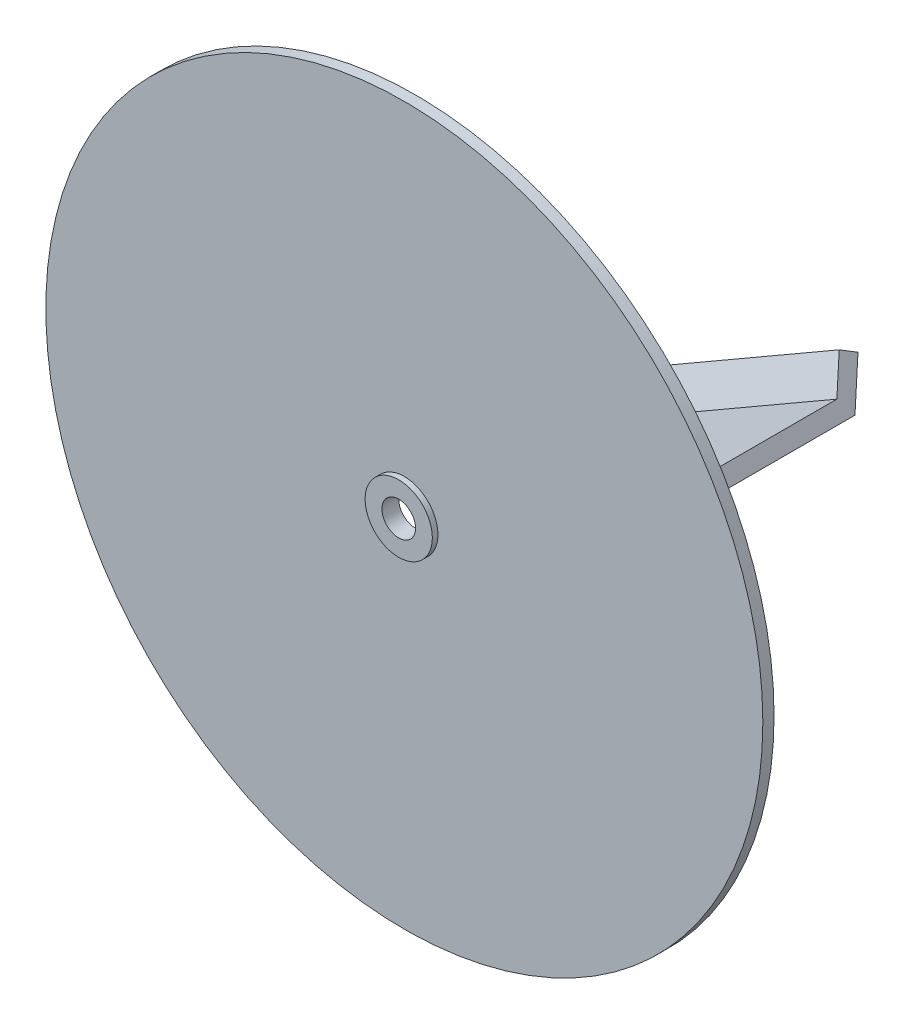
ISO-10303-21;
HEADER;
FILE_DESCRIPTION(('STEP AP214'),'2;1');
FILE_NAME('part.step','',(''),(''),'','','');
FILE_SCHEMA(('AUTOMOTIVE_DESIGN { 1 0 10303 214 1 1 1 1 }'));
ENDSEC;
DATA;
#1=APPLICATION_CONTEXT('core data for automotive mechanical design processes');
#2=APPLICATION_PROTOCOL_DEFINITION('international standard','automotive_design',2000,#1);
#3=PRODUCT_CONTEXT('',#1,'mechanical');
#4=PRODUCT('Part','Part','',(#3));
#5=PRODUCT_RELATED_PRODUCT_CATEGORY('part','',(#4));
#6=PRODUCT_DEFINITION_FORMATION('','',#4);
#7=PRODUCT_DEFINITION_CONTEXT('part definition',#1,'design');
#8=PRODUCT_DEFINITION('design','',#6,#7);
#9=PRODUCT_DEFINITION_SHAPE('','',#8);
#10=(LENGTH_UNIT() NAMED_UNIT(*) SI_UNIT(.MILLI.,.METRE.));
#11=(NAMED_UNIT(*) PLANE_ANGLE_UNIT() SI_UNIT($,.RADIAN.));
#12=(NAMED_UNIT(*) SI_UNIT($,.STERADIAN.) SOLID_ANGLE_UNIT());
#13=UNCERTAINTY_MEASURE_WITH_UNIT(LENGTH_MEASURE(1.E-05),#10,'distance_accuracy_value','');
#14=(GEOMETRIC_REPRESENTATION_CONTEXT(3) GLOBAL_UNCERTAINTY_ASSIGNED_CONTEXT((#13)) GLOBAL_UNIT_ASSIGNED_CONTEXT((#10,
#11,#12)) REPRESENTATION_CONTEXT('',''));
#15=CARTESIAN_POINT('',(0.,0.,0.));
#16=DIRECTION('',(0.,0.,1.));
#17=DIRECTION('',(1.,0.,0.));
#18=AXIS2_PLACEMENT_3D('',#15,#16,#17);
#19=CARTESIAN_POINT('',(0.,0.,6.35));
#20=DIRECTION('',(0.,0.,1.));
#21=DIRECTION('',(1.,0.,0.));
#22=AXIS2_PLACEMENT_3D('',#19,#20,#21);
#23=PLANE('',#22);
#24=CARTESIAN_POINT('',(0.,0.,6.35));
#25=DIRECTION('',(0.,0.,1.));
#26=DIRECTION('',(1.,0.,0.));
#27=AXIS2_PLACEMENT_3D('',#24,#25,#26);
#28=CIRCLE('',#27,203.2);
#29=CARTESIAN_POINT('',(203.2,0.,6.35));
#30=VERTEX_POINT('',#29);
#31=EDGE_CURVE('E11',#30,#30,#28,.T.);
#32=ORIENTED_EDGE('',*,*,#31,.T.);
#33=EDGE_LOOP('',(#32));
#34=FACE_BOUND('',#33,.T.);
#35=CARTESIAN_POINT('',(0.,0.,6.35));
#36=DIRECTION('',(0.,0.,1.));
#37=DIRECTION('',(1.,0.,0.));
#38=AXIS2_PLACEMENT_3D('',#35,#36,#37);
#39=CIRCLE('',#38,19.05);
#40=CARTESIAN_POINT('',(19.05,0.,6.35));
#41=VERTEX_POINT('',#40);
#42=EDGE_CURVE('E514',#41,#41,#39,.T.);
#43=ORIENTED_EDGE('',*,*,#42,.F.);
#44=EDGE_LOOP('',(#43));
#45=FACE_BOUND('',#44,.T.);
#46=ADVANCED_FACE('F48',(#34,#45),#23,.T.);
#47=CARTESIAN_POINT('',(0.,0.,0.));
#48=DIRECTION('',(0.,0.,1.));
#49=DIRECTION('',(1.,0.,0.));
#50=AXIS2_PLACEMENT_3D('',#47,#48,#49);
#51=PLANE('',#50);
#52=DIRECTION('',(0.866025403784443,-0.499999999999992,0.));
#53=VECTOR('',#52,1.);
#54=CARTESIAN_POINT('',(-168.095850734968,102.549445985522,0.));
#55=LINE('',#54,#53);
#56=CARTESIAN_POINT('',(-168.095850734968,102.549445985522,0.));
#57=VERTEX_POINT('',#56);
#58=CARTESIAN_POINT('',(-19.6157952561249,16.8244459855232,0.));
#59=VERTEX_POINT('',#58);
#60=EDGE_CURVE('E67',#57,#59,#55,.T.);
#61=ORIENTED_EDGE('',*,*,#60,.F.);
#62=DIRECTION('',(-0.499999999999992,-0.866025403784443,0.));
#63=VECTOR('',#62,1.);
#64=CARTESIAN_POINT('',(-172.858350734968,94.300554014475,0.));
#65=LINE('',#64,#63);
#66=CARTESIAN_POINT('',(-172.858350734968,94.300554014475,0.));
#67=VERTEX_POINT('',#66);
#68=EDGE_CURVE('E72',#57,#67,#65,.T.);
#69=ORIENTED_EDGE('',*,*,#68,.T.);
#70=DIRECTION('',(0.866025403784443,-0.499999999999992,0.));
#71=VECTOR('',#70,1.);
#72=CARTESIAN_POINT('',(-172.858350734968,94.300554014475,0.));
#73=LINE('',#72,#71);
#74=CARTESIAN_POINT('',(-24.3782952561248,8.57555401447638,0.));
#75=VERTEX_POINT('',#74);
#76=EDGE_CURVE('E198',#67,#75,#73,.T.);
#77=ORIENTED_EDGE('',*,*,#76,.T.);
#78=DIRECTION('',(-0.499999999999992,-0.866025403784443,0.));
#79=VECTOR('',#78,1.);
#80=CARTESIAN_POINT('',(-24.3782952561248,8.57555401447638,0.));
#81=LINE('',#80,#79);
#82=EDGE_CURVE('E228',#59,#75,#81,.T.);
#83=ORIENTED_EDGE('',*,*,#82,.F.);
#84=EDGE_LOOP('',(#61,#69,#77,#83));
#85=FACE_BOUND('',#84,.T.);
#86=DIRECTION('',(-0.866025403784436,-0.500000000000004,0.));
#87=VECTOR('',#86,1.);
#88=CARTESIAN_POINT('',(172.858350734966,94.3005540144774,0.));
#89=LINE('',#88,#87);
#90=CARTESIAN_POINT('',(172.858350734966,94.3005540144774,0.));
#91=VERTEX_POINT('',#90);
#92=CARTESIAN_POINT('',(24.3782952561247,8.57555401447672,0.));
#93=VERTEX_POINT('',#92);
#94=EDGE_CURVE('E309',#91,#93,#89,.T.);
#95=ORIENTED_EDGE('',*,*,#94,.F.);
#96=DIRECTION('',(-0.500000000000004,0.866025403784436,0.));
#97=VECTOR('',#96,1.);
#98=CARTESIAN_POINT('',(168.095850734966,102.549445985524,0.));
#99=LINE('',#98,#97);
#100=CARTESIAN_POINT('',(168.095850734966,102.549445985524,0.));
#101=VERTEX_POINT('',#100);
#102=EDGE_CURVE('E262',#91,#101,#99,.T.);
#103=ORIENTED_EDGE('',*,*,#102,.T.);
#104=DIRECTION('',(-0.866025403784436,-0.500000000000004,0.));
#105=VECTOR('',#104,1.);
#106=CARTESIAN_POINT('',(168.095850734966,102.549445985524,0.));
#107=LINE('',#106,#105);
#108=CARTESIAN_POINT('',(19.6157952561247,16.8244459855235,0.));
#109=VERTEX_POINT('',#108);
#110=EDGE_CURVE('E286',#101,#109,#107,.T.);
#111=ORIENTED_EDGE('',*,*,#110,.T.);
#112=DIRECTION('',(-0.500000000000004,0.866025403784436,0.));
#113=VECTOR('',#112,1.);
#114=CARTESIAN_POINT('',(19.6157952561247,16.8244459855235,0.));
#115=LINE('',#114,#113);
#116=EDGE_CURVE('E251',#93,#109,#115,.T.);
#117=ORIENTED_EDGE('',*,*,#116,.F.);
#118=EDGE_LOOP('',(#95,#103,#111,#117));
#119=FACE_BOUND('',#118,.T.);
#120=DIRECTION('',(0.,1.,0.));
#121=VECTOR('',#120,1.);
#122=CARTESIAN_POINT('',(-4.7625,-196.85,0.));
#123=LINE('',#122,#121);
#124=CARTESIAN_POINT('',(-4.7625,-196.85,0.));
#125=VERTEX_POINT('',#124);
#126=CARTESIAN_POINT('',(-4.7625,-25.4,0.));
#127=VERTEX_POINT('',#126);
#128=EDGE_CURVE('E375',#125,#127,#123,.T.);
#129=ORIENTED_EDGE('',*,*,#128,.F.);
#130=DIRECTION('',(1.,0.,0.));
#131=VECTOR('',#130,1.);
#132=CARTESIAN_POINT('',(4.7625,-196.85,0.));
#133=LINE('',#132,#131);
#134=CARTESIAN_POINT('',(4.7625,-196.85,0.));
#135=VERTEX_POINT('',#134);
#136=EDGE_CURVE('E328',#125,#135,#133,.T.);
#137=ORIENTED_EDGE('',*,*,#136,.T.);
#138=DIRECTION('',(0.,1.,0.));
#139=VECTOR('',#138,1.);
#140=CARTESIAN_POINT('',(4.7625,-196.85,0.));
#141=LINE('',#140,#139);
#142=CARTESIAN_POINT('',(4.7625,-25.4,0.));
#143=VERTEX_POINT('',#142);
#144=EDGE_CURVE('E352',#135,#143,#141,.T.);
#145=ORIENTED_EDGE('',*,*,#144,.T.);
#146=DIRECTION('',(1.,0.,0.));
#147=VECTOR('',#146,1.);
#148=CARTESIAN_POINT('',(4.7625,-25.4,0.));
#149=LINE('',#148,#147);
#150=EDGE_CURVE('E313',#127,#143,#149,.T.);
#151=ORIENTED_EDGE('',*,*,#150,.F.);
#152=EDGE_LOOP('',(#129,#137,#145,#151));
#153=FACE_BOUND('',#152,.T.);
#154=CARTESIAN_POINT('',(0.,0.,0.));
#155=DIRECTION('',(0.,0.,1.));
#156=DIRECTION('',(1.,0.,0.));
#157=AXIS2_PLACEMENT_3D('',#154,#155,#156);
#158=CIRCLE('',#157,203.2);
#159=CARTESIAN_POINT('',(203.2,0.,0.));
#160=VERTEX_POINT('',#159);
#161=EDGE_CURVE('E52',#160,#160,#158,.T.);
#162=ORIENTED_EDGE('',*,*,#161,.F.);
#163=EDGE_LOOP('',(#162));
#164=FACE_BOUND('',#163,.T.);
#165=CARTESIAN_POINT('',(0.,0.,0.));
#166=DIRECTION('',(0.,0.,1.));
#167=DIRECTION('',(1.,0.,0.));
#168=AXIS2_PLACEMENT_3D('',#165,#166,#167);
#169=CIRCLE('',#168,9.525);
#170=CARTESIAN_POINT('',(9.525,0.,0.));
#171=VERTEX_POINT('',#170);
#172=EDGE_CURVE('E379',#171,#171,#169,.T.);
#173=ORIENTED_EDGE('',*,*,#172,.T.);
#174=EDGE_LOOP('',(#173));
#175=FACE_BOUND('',#174,.T.);
#176=ADVANCED_FACE('F405',(#85,#119,#153,#164,#175),#51,.F.);
#177=CARTESIAN_POINT('',(0.,0.,6.35));
#178=DIRECTION('',(0.,0.,-1.));
#179=DIRECTION('',(-1.,0.,0.));
#180=AXIS2_PLACEMENT_3D('',#177,#178,#179);
#181=CYLINDRICAL_SURFACE('',#180,203.2);
#182=ORIENTED_EDGE('',*,*,#31,.F.);
#183=EDGE_LOOP('',(#182));
#184=FACE_BOUND('',#183,.T.);
#185=ORIENTED_EDGE('',*,*,#161,.T.);
#186=EDGE_LOOP('',(#185));
#187=FACE_BOUND('',#186,.T.);
#188=ADVANCED_FACE('F50',(#184,#187),#181,.T.);
#189=CARTESIAN_POINT('',(0.,0.,6.35));
#190=DIRECTION('',(0.,0.,-1.));
#191=DIRECTION('',(-1.,0.,0.));
#192=AXIS2_PLACEMENT_3D('',#189,#190,#191);
#193=CYLINDRICAL_SURFACE('',#192,9.525);
#194=ORIENTED_EDGE('',*,*,#172,.F.);
#195=EDGE_LOOP('',(#194));
#196=FACE_BOUND('',#195,.T.);
#197=CARTESIAN_POINT('',(0.,0.,9.525));
#198=DIRECTION('',(0.,0.,1.));
#199=DIRECTION('',(1.,0.,0.));
#200=AXIS2_PLACEMENT_3D('',#197,#198,#199);
#201=CIRCLE('',#200,9.525);
#202=CARTESIAN_POINT('',(9.525,0.,9.525));
#203=VERTEX_POINT('',#202);
#204=EDGE_CURVE('E512',#203,#203,#201,.T.);
#205=ORIENTED_EDGE('',*,*,#204,.T.);
#206=EDGE_LOOP('',(#205));
#207=FACE_BOUND('',#206,.T.);
#208=ADVANCED_FACE('F411',(#196,#207),#193,.F.);
#209=CARTESIAN_POINT('',(-4.7625,-196.85,0.));
#210=DIRECTION('',(-1.,0.,0.));
#211=DIRECTION('',(0.,0.,1.));
#212=AXIS2_PLACEMENT_3D('',#209,#210,#211);
#213=PLANE('',#212);
#214=DIRECTION('',(0.,0.,1.));
#215=VECTOR('',#214,1.);
#216=CARTESIAN_POINT('',(-4.7625,-25.4,0.));
#217=LINE('',#216,#215);
#218=CARTESIAN_POINT('',(-4.7625,-25.4,-76.2));
#219=VERTEX_POINT('',#218);
#220=EDGE_CURVE('E332',#219,#127,#217,.T.);
#221=ORIENTED_EDGE('',*,*,#220,.F.);
#222=DIRECTION('',(0.,1.,0.));
#223=VECTOR('',#222,1.);
#224=CARTESIAN_POINT('',(-4.7625,-196.85,-76.2));
#225=LINE('',#224,#223);
#226=CARTESIAN_POINT('',(-4.7625,-196.85,-76.2));
#227=VERTEX_POINT('',#226);
#228=EDGE_CURVE('E380',#227,#219,#225,.T.);
#229=ORIENTED_EDGE('',*,*,#228,.F.);
#230=DIRECTION('',(0.,0.,1.));
#231=VECTOR('',#230,1.);
#232=CARTESIAN_POINT('',(-4.7625,-196.85,0.));
#233=LINE('',#232,#231);
#234=EDGE_CURVE('E348',#227,#125,#233,.T.);
#235=ORIENTED_EDGE('',*,*,#234,.T.);
#236=ORIENTED_EDGE('',*,*,#128,.T.);
#237=EDGE_LOOP('',(#221,#229,#235,#236));
#238=FACE_BOUND('',#237,.T.);
#239=ADVANCED_FACE('F419',(#238),#213,.T.);
#240=CARTESIAN_POINT('',(-4.7625,-196.85,-76.2));
#241=DIRECTION('',(-0.499999999999998,0.,-0.86602540378444));
#242=DIRECTION('',(-0.86602540378444,0.,0.499999999999998));
#243=AXIS2_PLACEMENT_3D('',#240,#241,#242);
#244=PLANE('',#243);
#245=DIRECTION('',(-0.86602540378444,0.,0.499999999999998));
#246=VECTOR('',#245,1.);
#247=CARTESIAN_POINT('',(-4.7625,-25.4,-76.2));
#248=LINE('',#247,#246);
#249=CARTESIAN_POINT('',(17.2345452561248,-25.4,-88.8999999999999));
#250=VERTEX_POINT('',#249);
#251=EDGE_CURVE('E368',#250,#219,#248,.T.);
#252=ORIENTED_EDGE('',*,*,#251,.F.);
#253=DIRECTION('',(0.,1.,0.));
#254=VECTOR('',#253,1.);
#255=CARTESIAN_POINT('',(17.2345452561248,-196.85,-88.8999999999999));
#256=LINE('',#255,#254);
#257=CARTESIAN_POINT('',(17.2345452561248,-196.85,-88.8999999999999));
#258=VERTEX_POINT('',#257);
#259=EDGE_CURVE('E383',#258,#250,#256,.T.);
#260=ORIENTED_EDGE('',*,*,#259,.F.);
#261=DIRECTION('',(-0.86602540378444,0.,0.499999999999998));
#262=VECTOR('',#261,1.);
#263=CARTESIAN_POINT('',(-4.7625,-196.85,-76.2));
#264=LINE('',#263,#262);
#265=EDGE_CURVE('E344',#258,#227,#264,.T.);
#266=ORIENTED_EDGE('',*,*,#265,.T.);
#267=ORIENTED_EDGE('',*,*,#228,.T.);
#268=EDGE_LOOP('',(#252,#260,#266,#267));
#269=FACE_BOUND('',#268,.T.);
#270=ADVANCED_FACE('F433',(#269),#244,.T.);
#271=CARTESIAN_POINT('',(17.2345452561248,-196.85,-88.8999999999999));
#272=DIRECTION('',(0.86602540378444,0.,-0.499999999999998));
#273=DIRECTION('',(-0.499999999999998,0.,-0.86602540378444));
#274=AXIS2_PLACEMENT_3D('',#271,#272,#273);
#275=PLANE('',#274);
#276=DIRECTION('',(-0.499999999999998,0.,-0.86602540378444));
#277=VECTOR('',#276,1.);
#278=CARTESIAN_POINT('',(17.2345452561248,-25.4,-88.8999999999999));
#279=LINE('',#278,#277);
#280=CARTESIAN_POINT('',(21.9970452561248,-25.4,-80.6511080289532));
#281=VERTEX_POINT('',#280);
#282=EDGE_CURVE('E364',#281,#250,#279,.T.);
#283=ORIENTED_EDGE('',*,*,#282,.F.);
#284=DIRECTION('',(0.,1.,0.));
#285=VECTOR('',#284,1.);
#286=CARTESIAN_POINT('',(21.9970452561248,-196.85,-80.6511080289532));
#287=LINE('',#286,#285);
#288=CARTESIAN_POINT('',(21.9970452561248,-196.85,-80.6511080289532));
#289=VERTEX_POINT('',#288);
#290=EDGE_CURVE('E386',#289,#281,#287,.T.);
#291=ORIENTED_EDGE('',*,*,#290,.F.);
#292=DIRECTION('',(-0.499999999999998,0.,-0.86602540378444));
#293=VECTOR('',#292,1.);
#294=CARTESIAN_POINT('',(17.2345452561248,-196.85,-88.8999999999999));
#295=LINE('',#294,#293);
#296=EDGE_CURVE('E340',#289,#258,#295,.T.);
#297=ORIENTED_EDGE('',*,*,#296,.T.);
#298=ORIENTED_EDGE('',*,*,#259,.T.);
#299=EDGE_LOOP('',(#283,#291,#297,#298));
#300=FACE_BOUND('',#299,.T.);
#301=ADVANCED_FACE('F429',(#300),#275,.T.);
#302=CARTESIAN_POINT('',(21.9970452561248,-196.85,-80.6511080289532));
#303=DIRECTION('',(0.499999999999998,0.,0.86602540378444));
#304=DIRECTION('',(0.86602540378444,0.,-0.499999999999998));
#305=AXIS2_PLACEMENT_3D('',#302,#303,#304);
#306=PLANE('',#305);
#307=DIRECTION('',(0.86602540378444,0.,-0.499999999999998));
#308=VECTOR('',#307,1.);
#309=CARTESIAN_POINT('',(21.9970452561248,-25.4,-80.6511080289532));
#310=LINE('',#309,#308);
#311=CARTESIAN_POINT('',(4.7625,-25.4,-70.7007386859688));
#312=VERTEX_POINT('',#311);
#313=EDGE_CURVE('E360',#312,#281,#310,.T.);
#314=ORIENTED_EDGE('',*,*,#313,.F.);
#315=DIRECTION('',(0.,1.,0.));
#316=VECTOR('',#315,1.);
#317=CARTESIAN_POINT('',(4.7625,-196.85,-70.7007386859688));
#318=LINE('',#317,#316);
#319=CARTESIAN_POINT('',(4.7625,-196.85,-70.7007386859688));
#320=VERTEX_POINT('',#319);
#321=EDGE_CURVE('E389',#320,#312,#318,.T.);
#322=ORIENTED_EDGE('',*,*,#321,.F.);
#323=DIRECTION('',(0.86602540378444,0.,-0.499999999999998));
#324=VECTOR('',#323,1.);
#325=CARTESIAN_POINT('',(21.9970452561248,-196.85,-80.6511080289532));
#326=LINE('',#325,#324);
#327=EDGE_CURVE('E336',#320,#289,#326,.T.);
#328=ORIENTED_EDGE('',*,*,#327,.T.);
#329=ORIENTED_EDGE('',*,*,#290,.T.);
#330=EDGE_LOOP('',(#314,#322,#328,#329));
#331=FACE_BOUND('',#330,.T.);
#332=ADVANCED_FACE('F425',(#331),#306,.T.);
#333=CARTESIAN_POINT('',(4.7625,-196.85,-70.7007386859688));
#334=DIRECTION('',(1.,0.,0.));
#335=DIRECTION('',(0.,0.,-1.));
#336=AXIS2_PLACEMENT_3D('',#333,#334,#335);
#337=PLANE('',#336);
#338=DIRECTION('',(0.,0.,-1.));
#339=VECTOR('',#338,1.);
#340=CARTESIAN_POINT('',(4.7625,-25.4,-70.7007386859688));
#341=LINE('',#340,#339);
#342=EDGE_CURVE('E356',#143,#312,#341,.T.);
#343=ORIENTED_EDGE('',*,*,#342,.F.);
#344=ORIENTED_EDGE('',*,*,#144,.F.);
#345=DIRECTION('',(0.,0.,-1.));
#346=VECTOR('',#345,1.);
#347=CARTESIAN_POINT('',(4.7625,-196.85,-70.7007386859688));
#348=LINE('',#347,#346);
#349=EDGE_CURVE('E331',#135,#320,#348,.T.);
#350=ORIENTED_EDGE('',*,*,#349,.T.);
#351=ORIENTED_EDGE('',*,*,#321,.T.);
#352=EDGE_LOOP('',(#343,#344,#350,#351));
#353=FACE_BOUND('',#352,.T.);
#354=ADVANCED_FACE('F421',(#353),#337,.T.);
#355=CARTESIAN_POINT('',(0.,-196.85,0.));
#356=DIRECTION('',(0.,-1.,0.));
#357=DIRECTION('',(0.,0.,-1.));
#358=AXIS2_PLACEMENT_3D('',#355,#356,#357);
#359=PLANE('',#358);
#360=ORIENTED_EDGE('',*,*,#136,.F.);
#361=ORIENTED_EDGE('',*,*,#234,.F.);
#362=ORIENTED_EDGE('',*,*,#265,.F.);
#363=ORIENTED_EDGE('',*,*,#296,.F.);
#364=ORIENTED_EDGE('',*,*,#327,.F.);
#365=ORIENTED_EDGE('',*,*,#349,.F.);
#366=EDGE_LOOP('',(#360,#361,#362,#363,#364,#365));
#367=FACE_BOUND('',#366,.T.);
#368=ADVANCED_FACE('F424',(#367),#359,.T.);
#369=CARTESIAN_POINT('',(0.,-25.4,0.));
#370=DIRECTION('',(0.,-1.,0.));
#371=DIRECTION('',(0.,0.,-1.));
#372=AXIS2_PLACEMENT_3D('',#369,#370,#371);
#373=PLANE('',#372);
#374=ORIENTED_EDGE('',*,*,#150,.T.);
#375=ORIENTED_EDGE('',*,*,#342,.T.);
#376=ORIENTED_EDGE('',*,*,#313,.T.);
#377=ORIENTED_EDGE('',*,*,#282,.T.);
#378=ORIENTED_EDGE('',*,*,#251,.T.);
#379=ORIENTED_EDGE('',*,*,#220,.T.);
#380=EDGE_LOOP('',(#374,#375,#376,#377,#378,#379));
#381=FACE_BOUND('',#380,.T.);
#382=ADVANCED_FACE('F441',(#381),#373,.F.);
#383=CARTESIAN_POINT('',(172.858350734966,94.3005540144774,0.));
#384=DIRECTION('',(0.500000000000004,-0.866025403784436,0.));
#385=DIRECTION('',(0.866025403784436,0.500000000000004,0.));
#386=AXIS2_PLACEMENT_3D('',#383,#384,#385);
#387=PLANE('',#386);
#388=DIRECTION('',(0.,0.,1.));
#389=VECTOR('',#388,1.);
#390=CARTESIAN_POINT('',(24.3782952561247,8.57555401447672,0.));
#391=LINE('',#390,#389);
#392=CARTESIAN_POINT('',(24.3782952561247,8.57555401447672,-76.2));
#393=VERTEX_POINT('',#392);
#394=EDGE_CURVE('E266',#393,#93,#391,.T.);
#395=ORIENTED_EDGE('',*,*,#394,.F.);
#396=DIRECTION('',(-0.866025403784436,-0.500000000000004,0.));
#397=VECTOR('',#396,1.);
#398=CARTESIAN_POINT('',(172.858350734966,94.3005540144774,-76.2));
#399=LINE('',#398,#397);
#400=CARTESIAN_POINT('',(172.858350734966,94.3005540144774,-76.2));
#401=VERTEX_POINT('',#400);
#402=EDGE_CURVE('E314',#401,#393,#399,.T.);
#403=ORIENTED_EDGE('',*,*,#402,.F.);
#404=DIRECTION('',(0.,0.,1.));
#405=VECTOR('',#404,1.);
#406=CARTESIAN_POINT('',(172.858350734966,94.3005540144774,0.));
#407=LINE('',#406,#405);
#408=EDGE_CURVE('E282',#401,#91,#407,.T.);
#409=ORIENTED_EDGE('',*,*,#408,.T.);
#410=ORIENTED_EDGE('',*,*,#94,.T.);
#411=EDGE_LOOP('',(#395,#403,#409,#410));
#412=FACE_BOUND('',#411,.T.);
#413=ADVANCED_FACE('F444',(#412),#387,.T.);
#414=CARTESIAN_POINT('',(172.858350734966,94.3005540144774,-76.2));
#415=DIRECTION('',(0.250000000000001,-0.433012701892216,-0.86602540378444));
#416=DIRECTION('',(0.,0.894427190999917,-0.447213595499955));
#417=AXIS2_PLACEMENT_3D('',#414,#415,#416);
#418=PLANE('',#417);
#419=DIRECTION('',(0.433012701892223,-0.749999999999999,0.499999999999998));
#420=VECTOR('',#419,1.);
#421=CARTESIAN_POINT('',(24.3782952561247,8.57555401447672,-76.2));
#422=LINE('',#421,#420);
#423=CARTESIAN_POINT('',(13.3797726280622,27.6255540144767,-88.8999999999999));
#424=VERTEX_POINT('',#423);
#425=EDGE_CURVE('E302',#424,#393,#422,.T.);
#426=ORIENTED_EDGE('',*,*,#425,.F.);
#427=DIRECTION('',(-0.866025403784436,-0.500000000000004,0.));
#428=VECTOR('',#427,1.);
#429=CARTESIAN_POINT('',(161.859828106904,113.350554014477,-88.8999999999999));
#430=LINE('',#429,#428);
#431=CARTESIAN_POINT('',(161.859828106904,113.350554014477,-88.8999999999999));
#432=VERTEX_POINT('',#431);
#433=EDGE_CURVE('E317',#432,#424,#430,.T.);
#434=ORIENTED_EDGE('',*,*,#433,.F.);
#435=DIRECTION('',(0.433012701892223,-0.749999999999999,0.499999999999998));
#436=VECTOR('',#435,1.);
#437=CARTESIAN_POINT('',(172.858350734966,94.3005540144774,-76.2));
#438=LINE('',#437,#436);
#439=EDGE_CURVE('E278',#432,#401,#438,.T.);
#440=ORIENTED_EDGE('',*,*,#439,.T.);
#441=ORIENTED_EDGE('',*,*,#402,.T.);
#442=EDGE_LOOP('',(#426,#434,#440,#441));
#443=FACE_BOUND('',#442,.T.);
#444=ADVANCED_FACE('F461',(#443),#418,.T.);
#445=CARTESIAN_POINT('',(161.859828106904,113.350554014477,-88.8999999999999));
#446=DIRECTION('',(-0.433012701892223,0.749999999999999,-0.499999999999998));
#447=DIRECTION('',(0.,0.554700196225228,0.832050294337844));
#448=AXIS2_PLACEMENT_3D('',#445,#446,#447);
#449=PLANE('',#448);
#450=DIRECTION('',(0.250000000000001,-0.433012701892217,-0.86602540378444));
#451=VECTOR('',#450,1.);
#452=CARTESIAN_POINT('',(13.3797726280622,27.6255540144767,-88.8999999999999));
#453=LINE('',#452,#451);
#454=CARTESIAN_POINT('',(10.9985226280622,31.7500000000001,-80.6511080289532));
#455=VERTEX_POINT('',#454);
#456=EDGE_CURVE('E298',#455,#424,#453,.T.);
#457=ORIENTED_EDGE('',*,*,#456,.F.);
#458=DIRECTION('',(-0.866025403784436,-0.500000000000004,0.));
#459=VECTOR('',#458,1.);
#460=CARTESIAN_POINT('',(159.478578106904,117.475000000001,-80.6511080289532));
#461=LINE('',#460,#459);
#462=CARTESIAN_POINT('',(159.478578106904,117.475000000001,-80.6511080289532));
#463=VERTEX_POINT('',#462);
#464=EDGE_CURVE('E320',#463,#455,#461,.T.);
#465=ORIENTED_EDGE('',*,*,#464,.F.);
#466=DIRECTION('',(0.250000000000001,-0.433012701892217,-0.86602540378444));
#467=VECTOR('',#466,1.);
#468=CARTESIAN_POINT('',(161.859828106904,113.350554014477,-88.8999999999999));
#469=LINE('',#468,#467);
#470=EDGE_CURVE('E274',#463,#432,#469,.T.);
#471=ORIENTED_EDGE('',*,*,#470,.T.);
#472=ORIENTED_EDGE('',*,*,#433,.T.);
#473=EDGE_LOOP('',(#457,#465,#471,#472));
#474=FACE_BOUND('',#473,.T.);
#475=ADVANCED_FACE('F457',(#474),#449,.T.);
#476=CARTESIAN_POINT('',(159.478578106904,117.475000000001,-80.6511080289532));
#477=DIRECTION('',(-0.250000000000001,0.433012701892216,0.86602540378444));
#478=DIRECTION('',(0.,-0.894427190999917,0.447213595499955));
#479=AXIS2_PLACEMENT_3D('',#476,#477,#478);
#480=PLANE('',#479);
#481=DIRECTION('',(-0.433012701892223,0.749999999999999,-0.499999999999998));
#482=VECTOR('',#481,1.);
#483=CARTESIAN_POINT('',(10.9985226280622,31.7500000000001,-80.6511080289532));
#484=LINE('',#483,#482);
#485=CARTESIAN_POINT('',(19.6157952561247,16.8244459855235,-70.7007386859688));
#486=VERTEX_POINT('',#485);
#487=EDGE_CURVE('E294',#486,#455,#484,.T.);
#488=ORIENTED_EDGE('',*,*,#487,.F.);
#489=DIRECTION('',(-0.866025403784436,-0.500000000000004,0.));
#490=VECTOR('',#489,1.);
#491=CARTESIAN_POINT('',(168.095850734966,102.549445985524,-70.7007386859688));
#492=LINE('',#491,#490);
#493=CARTESIAN_POINT('',(168.095850734966,102.549445985524,-70.7007386859688));
#494=VERTEX_POINT('',#493);
#495=EDGE_CURVE('E323',#494,#486,#492,.T.);
#496=ORIENTED_EDGE('',*,*,#495,.F.);
#497=DIRECTION('',(-0.433012701892223,0.749999999999999,-0.499999999999998));
#498=VECTOR('',#497,1.);
#499=CARTESIAN_POINT('',(159.478578106904,117.475000000001,-80.6511080289532));
#500=LINE('',#499,#498);
#501=EDGE_CURVE('E270',#494,#463,#500,.T.);
#502=ORIENTED_EDGE('',*,*,#501,.T.);
#503=ORIENTED_EDGE('',*,*,#464,.T.);
#504=EDGE_LOOP('',(#488,#496,#502,#503));
#505=FACE_BOUND('',#504,.T.);
#506=ADVANCED_FACE('F453',(#505),#480,.T.);
#507=CARTESIAN_POINT('',(168.095850734966,102.549445985524,-70.7007386859688));
#508=DIRECTION('',(-0.500000000000004,0.866025403784436,0.));
#509=DIRECTION('',(-0.866025403784436,-0.500000000000004,0.));
#510=AXIS2_PLACEMENT_3D('',#507,#508,#509);
#511=PLANE('',#510);
#512=DIRECTION('',(0.,0.,-1.));
#513=VECTOR('',#512,1.);
#514=CARTESIAN_POINT('',(19.6157952561247,16.8244459855235,-70.7007386859688));
#515=LINE('',#514,#513);
#516=EDGE_CURVE('E290',#109,#486,#515,.T.);
#517=ORIENTED_EDGE('',*,*,#516,.F.);
#518=ORIENTED_EDGE('',*,*,#110,.F.);
#519=DIRECTION('',(0.,0.,-1.));
#520=VECTOR('',#519,1.);
#521=CARTESIAN_POINT('',(168.095850734966,102.549445985524,-70.7007386859688));
#522=LINE('',#521,#520);
#523=EDGE_CURVE('E265',#101,#494,#522,.T.);
#524=ORIENTED_EDGE('',*,*,#523,.T.);
#525=ORIENTED_EDGE('',*,*,#495,.T.);
#526=EDGE_LOOP('',(#517,#518,#524,#525));
#527=FACE_BOUND('',#526,.T.);
#528=ADVANCED_FACE('F449',(#527),#511,.T.);
#529=CARTESIAN_POINT('',(170.477100734966,98.4250000000008,0.));
#530=DIRECTION('',(0.866025403784436,0.500000000000004,0.));
#531=DIRECTION('',(0.,0.,-1.));
#532=AXIS2_PLACEMENT_3D('',#529,#530,#531);
#533=PLANE('',#532);
#534=ORIENTED_EDGE('',*,*,#102,.F.);
#535=ORIENTED_EDGE('',*,*,#408,.F.);
#536=ORIENTED_EDGE('',*,*,#439,.F.);
#537=ORIENTED_EDGE('',*,*,#470,.F.);
#538=ORIENTED_EDGE('',*,*,#501,.F.);
#539=ORIENTED_EDGE('',*,*,#523,.F.);
#540=EDGE_LOOP('',(#534,#535,#536,#537,#538,#539));
#541=FACE_BOUND('',#540,.T.);
#542=ADVANCED_FACE('F452',(#541),#533,.T.);
#543=CARTESIAN_POINT('',(21.9970452561247,12.7000000000001,0.));
#544=DIRECTION('',(0.866025403784436,0.500000000000004,0.));
#545=DIRECTION('',(0.,0.,-1.));
#546=AXIS2_PLACEMENT_3D('',#543,#544,#545);
#547=PLANE('',#546);
#548=ORIENTED_EDGE('',*,*,#116,.T.);
#549=ORIENTED_EDGE('',*,*,#516,.T.);
#550=ORIENTED_EDGE('',*,*,#487,.T.);
#551=ORIENTED_EDGE('',*,*,#456,.T.);
#552=ORIENTED_EDGE('',*,*,#425,.T.);
#553=ORIENTED_EDGE('',*,*,#394,.T.);
#554=EDGE_LOOP('',(#548,#549,#550,#551,#552,#553));
#555=FACE_BOUND('',#554,.T.);
#556=ADVANCED_FACE('F469',(#555),#547,.F.);
#557=CARTESIAN_POINT('',(-168.095850734968,102.549445985522,0.));
#558=DIRECTION('',(0.499999999999992,0.866025403784443,0.));
#559=DIRECTION('',(-0.866025403784443,0.499999999999992,0.));
#560=AXIS2_PLACEMENT_3D('',#557,#558,#559);
#561=PLANE('',#560);
#562=DIRECTION('',(0.,0.,1.));
#563=VECTOR('',#562,1.);
#564=CARTESIAN_POINT('',(-19.6157952561249,16.8244459855232,0.));
#565=LINE('',#564,#563);
#566=CARTESIAN_POINT('',(-19.6157952561249,16.8244459855232,-76.2));
#567=VERTEX_POINT('',#566);
#568=EDGE_CURVE('E214',#567,#59,#565,.T.);
#569=ORIENTED_EDGE('',*,*,#568,.F.);
#570=DIRECTION('',(0.866025403784443,-0.499999999999992,0.));
#571=VECTOR('',#570,1.);
#572=CARTESIAN_POINT('',(-168.095850734968,102.549445985522,-76.2));
#573=LINE('',#572,#571);
#574=CARTESIAN_POINT('',(-168.095850734968,102.549445985522,-76.2));
#575=VERTEX_POINT('',#574);
#576=EDGE_CURVE('E252',#575,#567,#573,.T.);
#577=ORIENTED_EDGE('',*,*,#576,.F.);
#578=DIRECTION('',(0.,0.,1.));
#579=VECTOR('',#578,1.);
#580=CARTESIAN_POINT('',(-168.095850734968,102.549445985522,0.));
#581=LINE('',#580,#579);
#582=EDGE_CURVE('E224',#575,#57,#581,.T.);
#583=ORIENTED_EDGE('',*,*,#582,.T.);
#584=ORIENTED_EDGE('',*,*,#60,.T.);
#585=EDGE_LOOP('',(#569,#577,#583,#584));
#586=FACE_BOUND('',#585,.T.);
#587=ADVANCED_FACE('F472',(#586),#561,.T.);
#588=CARTESIAN_POINT('',(-168.095850734968,102.549445985522,-76.2));
#589=DIRECTION('',(0.249999999999995,0.43301270189222,-0.86602540378444));
#590=DIRECTION('',(0.,0.894427190999916,0.447213595499958));
#591=AXIS2_PLACEMENT_3D('',#588,#589,#590);
#592=PLANE('',#591);
#593=DIRECTION('',(0.433012701892213,0.750000000000005,0.499999999999998));
#594=VECTOR('',#593,1.);
#595=CARTESIAN_POINT('',(-19.6157952561249,16.8244459855232,-76.2));
#596=LINE('',#595,#594);
#597=CARTESIAN_POINT('',(-30.6143178841871,-2.22555401447692,-88.8999999999999));
#598=VERTEX_POINT('',#597);
#599=EDGE_CURVE('E242',#598,#567,#596,.T.);
#600=ORIENTED_EDGE('',*,*,#599,.F.);
#601=DIRECTION('',(0.866025403784443,-0.499999999999992,0.));
#602=VECTOR('',#601,1.);
#603=CARTESIAN_POINT('',(-179.09437336303,83.4994459855217,-88.8999999999999));
#604=LINE('',#603,#602);
#605=CARTESIAN_POINT('',(-179.09437336303,83.4994459855217,-88.8999999999999));
#606=VERTEX_POINT('',#605);
#607=EDGE_CURVE('E255',#606,#598,#604,.T.);
#608=ORIENTED_EDGE('',*,*,#607,.F.);
#609=DIRECTION('',(0.433012701892213,0.750000000000005,0.499999999999998));
#610=VECTOR('',#609,1.);
#611=CARTESIAN_POINT('',(-168.095850734968,102.549445985522,-76.2));
#612=LINE('',#611,#610);
#613=EDGE_CURVE('E220',#606,#575,#612,.T.);
#614=ORIENTED_EDGE('',*,*,#613,.T.);
#615=ORIENTED_EDGE('',*,*,#576,.T.);
#616=EDGE_LOOP('',(#600,#608,#614,#615));
#617=FACE_BOUND('',#616,.T.);
#618=ADVANCED_FACE('F484',(#617),#592,.T.);
#619=CARTESIAN_POINT('',(-179.09437336303,83.4994459855217,-88.8999999999999));
#620=DIRECTION('',(-0.433012701892213,-0.750000000000005,-0.499999999999998));
#621=DIRECTION('',(0.,0.554700196225225,-0.832050294337846));
#622=AXIS2_PLACEMENT_3D('',#619,#620,#621);
#623=PLANE('',#622);
#624=DIRECTION('',(0.249999999999995,0.43301270189222,-0.86602540378444));
#625=VECTOR('',#624,1.);
#626=CARTESIAN_POINT('',(-30.6143178841871,-2.22555401447692,-88.8999999999999));
#627=LINE('',#626,#625);
#628=CARTESIAN_POINT('',(-32.9955678841871,-6.35000000000032,-80.6511080289532));
#629=VERTEX_POINT('',#628);
#630=EDGE_CURVE('E238',#629,#598,#627,.T.);
#631=ORIENTED_EDGE('',*,*,#630,.F.);
#632=DIRECTION('',(0.866025403784443,-0.499999999999992,0.));
#633=VECTOR('',#632,1.);
#634=CARTESIAN_POINT('',(-181.47562336303,79.3749999999983,-80.6511080289532));
#635=LINE('',#634,#633);
#636=CARTESIAN_POINT('',(-181.47562336303,79.3749999999983,-80.6511080289532));
#637=VERTEX_POINT('',#636);
#638=EDGE_CURVE('E197',#637,#629,#635,.T.);
#639=ORIENTED_EDGE('',*,*,#638,.F.);
#640=DIRECTION('',(0.249999999999995,0.43301270189222,-0.86602540378444));
#641=VECTOR('',#640,1.);
#642=CARTESIAN_POINT('',(-179.09437336303,83.4994459855217,-88.8999999999999));
#643=LINE('',#642,#641);
#644=EDGE_CURVE('E207',#637,#606,#643,.T.);
#645=ORIENTED_EDGE('',*,*,#644,.T.);
#646=ORIENTED_EDGE('',*,*,#607,.T.);
#647=EDGE_LOOP('',(#631,#639,#645,#646));
#648=FACE_BOUND('',#647,.T.);
#649=ADVANCED_FACE('F481',(#648),#623,.T.);
#650=CARTESIAN_POINT('',(-181.47562336303,79.3749999999983,-80.6511080289532));
#651=DIRECTION('',(-0.249999999999995,-0.43301270189222,0.86602540378444));
#652=DIRECTION('',(0.,-0.894427190999916,-0.447213595499958));
#653=AXIS2_PLACEMENT_3D('',#650,#651,#652);
#654=PLANE('',#653);
#655=DIRECTION('',(-0.433012701892213,-0.750000000000005,-0.499999999999998));
#656=VECTOR('',#655,1.);
#657=CARTESIAN_POINT('',(-32.9955678841871,-6.35000000000032,-80.6511080289532));
#658=LINE('',#657,#656);
#659=CARTESIAN_POINT('',(-24.3782952561248,8.57555401447639,-70.7007386859688));
#660=VERTEX_POINT('',#659);
#661=EDGE_CURVE('E191',#660,#629,#658,.T.);
#662=ORIENTED_EDGE('',*,*,#661,.F.);
#663=DIRECTION('',(0.866025403784443,-0.499999999999992,0.));
#664=VECTOR('',#663,1.);
#665=CARTESIAN_POINT('',(-172.858350734968,94.300554014475,-70.7007386859688));
#666=LINE('',#665,#664);
#667=CARTESIAN_POINT('',(-172.858350734968,94.300554014475,-70.7007386859688));
#668=VERTEX_POINT('',#667);
#669=EDGE_CURVE('E186',#668,#660,#666,.T.);
#670=ORIENTED_EDGE('',*,*,#669,.F.);
#671=DIRECTION('',(-0.433012701892213,-0.750000000000005,-0.499999999999998));
#672=VECTOR('',#671,1.);
#673=CARTESIAN_POINT('',(-181.47562336303,79.3749999999983,-80.6511080289532));
#674=LINE('',#673,#672);
#675=EDGE_CURVE('E189',#668,#637,#674,.T.);
#676=ORIENTED_EDGE('',*,*,#675,.T.);
#677=ORIENTED_EDGE('',*,*,#638,.T.);
#678=EDGE_LOOP('',(#662,#670,#676,#677));
#679=FACE_BOUND('',#678,.T.);
#680=ADVANCED_FACE('F188',(#679),#654,.T.);
#681=CARTESIAN_POINT('',(-172.858350734968,94.300554014475,-70.7007386859688));
#682=DIRECTION('',(-0.499999999999992,-0.866025403784443,0.));
#683=DIRECTION('',(0.866025403784443,-0.499999999999992,0.));
#684=AXIS2_PLACEMENT_3D('',#681,#682,#683);
#685=PLANE('',#684);
#686=DIRECTION('',(0.,0.,-1.));
#687=VECTOR('',#686,1.);
#688=CARTESIAN_POINT('',(-24.3782952561248,8.57555401447639,-70.7007386859688));
#689=LINE('',#688,#687);
#690=EDGE_CURVE('E232',#75,#660,#689,.T.);
#691=ORIENTED_EDGE('',*,*,#690,.F.);
#692=ORIENTED_EDGE('',*,*,#76,.F.);
#693=DIRECTION('',(0.,0.,-1.));
#694=VECTOR('',#693,1.);
#695=CARTESIAN_POINT('',(-172.858350734968,94.300554014475,-70.7007386859688));
#696=LINE('',#695,#694);
#697=EDGE_CURVE('E204',#67,#668,#696,.T.);
#698=ORIENTED_EDGE('',*,*,#697,.T.);
#699=ORIENTED_EDGE('',*,*,#669,.T.);
#700=EDGE_LOOP('',(#691,#692,#698,#699));
#701=FACE_BOUND('',#700,.T.);
#702=ADVANCED_FACE('F210',(#701),#685,.T.);
#703=CARTESIAN_POINT('',(-170.477100734968,98.4249999999984,0.));
#704=DIRECTION('',(-0.866025403784443,0.499999999999992,0.));
#705=DIRECTION('',(0.,0.,-1.));
#706=AXIS2_PLACEMENT_3D('',#703,#704,#705);
#707=PLANE('',#706);
#708=ORIENTED_EDGE('',*,*,#68,.F.);
#709=ORIENTED_EDGE('',*,*,#582,.F.);
#710=ORIENTED_EDGE('',*,*,#613,.F.);
#711=ORIENTED_EDGE('',*,*,#644,.F.);
#712=ORIENTED_EDGE('',*,*,#675,.F.);
#713=ORIENTED_EDGE('',*,*,#697,.F.);
#714=EDGE_LOOP('',(#708,#709,#710,#711,#712,#713));
#715=FACE_BOUND('',#714,.T.);
#716=ADVANCED_FACE('F203',(#715),#707,.T.);
#717=CARTESIAN_POINT('',(-21.9970452561249,12.6999999999998,0.));
#718=DIRECTION('',(-0.866025403784443,0.499999999999992,0.));
#719=DIRECTION('',(0.,0.,-1.));
#720=AXIS2_PLACEMENT_3D('',#717,#718,#719);
#721=PLANE('',#720);
#722=ORIENTED_EDGE('',*,*,#82,.T.);
#723=ORIENTED_EDGE('',*,*,#690,.T.);
#724=ORIENTED_EDGE('',*,*,#661,.T.);
#725=ORIENTED_EDGE('',*,*,#630,.T.);
#726=ORIENTED_EDGE('',*,*,#599,.T.);
#727=ORIENTED_EDGE('',*,*,#568,.T.);
#728=EDGE_LOOP('',(#722,#723,#724,#725,#726,#727));
#729=FACE_BOUND('',#728,.T.);
#730=ADVANCED_FACE('F492',(#729),#721,.F.);
#731=CARTESIAN_POINT('',(0.,0.,9.525));
#732=DIRECTION('',(0.,0.,1.));
#733=DIRECTION('',(1.,0.,0.));
#734=AXIS2_PLACEMENT_3D('',#731,#732,#733);
#735=PLANE('',#734);
#736=CARTESIAN_POINT('',(0.,0.,9.525));
#737=DIRECTION('',(0.,0.,1.));
#738=DIRECTION('',(1.,0.,0.));
#739=AXIS2_PLACEMENT_3D('',#736,#737,#738);
#740=CIRCLE('',#739,19.05);
#741=CARTESIAN_POINT('',(19.05,0.,9.525));
#742=VERTEX_POINT('',#741);
#743=EDGE_CURVE('E233',#742,#742,#740,.T.);
#744=ORIENTED_EDGE('',*,*,#743,.T.);
#745=EDGE_LOOP('',(#744));
#746=FACE_BOUND('',#745,.T.);
#747=ORIENTED_EDGE('',*,*,#204,.F.);
#748=EDGE_LOOP('',(#747));
#749=FACE_BOUND('',#748,.T.);
#750=ADVANCED_FACE('F495',(#746,#749),#735,.T.);
#751=CARTESIAN_POINT('',(0.,0.,9.525));
#752=DIRECTION('',(0.,0.,-1.));
#753=DIRECTION('',(-1.,0.,0.));
#754=AXIS2_PLACEMENT_3D('',#751,#752,#753);
#755=CYLINDRICAL_SURFACE('',#754,19.05);
#756=ORIENTED_EDGE('',*,*,#743,.F.);
#757=EDGE_LOOP('',(#756));
#758=FACE_BOUND('',#757,.T.);
#759=ORIENTED_EDGE('',*,*,#42,.T.);
#760=EDGE_LOOP('',(#759));
#761=FACE_BOUND('',#760,.T.);
#762=ADVANCED_FACE('F499',(#758,#761),#755,.T.);
#763=CLOSED_SHELL('',(#46,#176,#188,#208,#239,#270,#301,#332,#354,#368,#382,#413,#444,#475,#506,
#528,#542,#556,#587,#618,#649,#680,#702,#716,#730,#750,#762));
#764=MANIFOLD_SOLID_BREP('B2',#763);
#765=ADVANCED_BREP_SHAPE_REPRESENTATION('',(#18,#764),#14);
#766=SHAPE_DEFINITION_REPRESENTATION(#9,#765);
ENDSEC;
END-ISO-10303-21;
